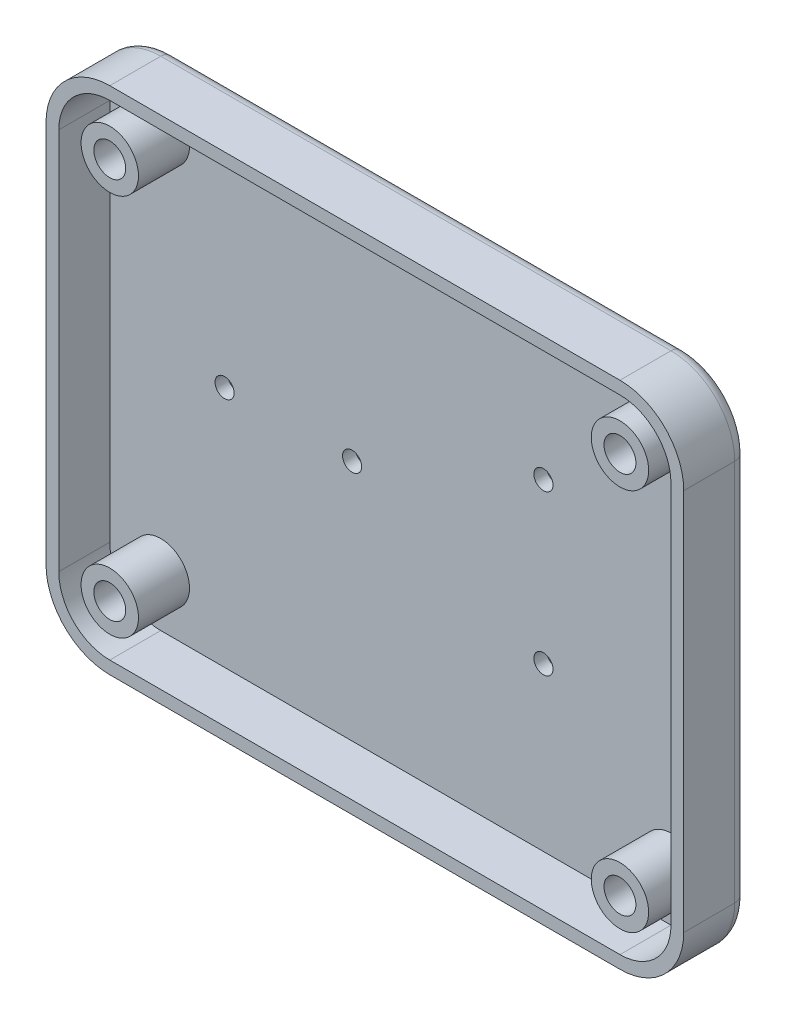
ISO-10303-21;
HEADER;
FILE_DESCRIPTION(('STEP AP214'),'2;1');
FILE_NAME('part.step','',(''),(''),'','','');
FILE_SCHEMA(('AUTOMOTIVE_DESIGN { 1 0 10303 214 1 1 1 1 }'));
ENDSEC;
DATA;
#1=APPLICATION_CONTEXT('core data for automotive mechanical design processes');
#2=APPLICATION_PROTOCOL_DEFINITION('international standard','automotive_design',2000,#1);
#3=PRODUCT_CONTEXT('',#1,'mechanical');
#4=PRODUCT('Part','Part','',(#3));
#5=PRODUCT_RELATED_PRODUCT_CATEGORY('part','',(#4));
#6=PRODUCT_DEFINITION_FORMATION('','',#4);
#7=PRODUCT_DEFINITION_CONTEXT('part definition',#1,'design');
#8=PRODUCT_DEFINITION('design','',#6,#7);
#9=PRODUCT_DEFINITION_SHAPE('','',#8);
#10=(LENGTH_UNIT() NAMED_UNIT(*) SI_UNIT(.MILLI.,.METRE.));
#11=(NAMED_UNIT(*) PLANE_ANGLE_UNIT() SI_UNIT($,.RADIAN.));
#12=(NAMED_UNIT(*) SI_UNIT($,.STERADIAN.) SOLID_ANGLE_UNIT());
#13=UNCERTAINTY_MEASURE_WITH_UNIT(LENGTH_MEASURE(1.E-05),#10,'distance_accuracy_value','');
#14=(GEOMETRIC_REPRESENTATION_CONTEXT(3) GLOBAL_UNCERTAINTY_ASSIGNED_CONTEXT((#13)) GLOBAL_UNIT_ASSIGNED_CONTEXT((#10,
#11,#12)) REPRESENTATION_CONTEXT('',''));
#15=CARTESIAN_POINT('',(0.,0.,0.));
#16=DIRECTION('',(0.,0.,1.));
#17=DIRECTION('',(1.,0.,0.));
#18=AXIS2_PLACEMENT_3D('',#15,#16,#17);
#19=CARTESIAN_POINT('',(0.,0.,10.));
#20=DIRECTION('',(0.,0.,1.));
#21=DIRECTION('',(1.,0.,0.));
#22=AXIS2_PLACEMENT_3D('',#19,#20,#21);
#23=PLANE('',#22);
#24=CARTESIAN_POINT('',(40.,30.,10.));
#25=DIRECTION('',(0.,0.,1.));
#26=DIRECTION('',(1.,0.,0.));
#27=AXIS2_PLACEMENT_3D('',#24,#25,#26);
#28=CIRCLE('',#27,2.5);
#29=CARTESIAN_POINT('',(42.5,30.,10.));
#30=VERTEX_POINT('',#29);
#31=EDGE_CURVE('E330',#30,#30,#28,.T.);
#32=ORIENTED_EDGE('',*,*,#31,.F.);
#33=EDGE_LOOP('',(#32));
#34=FACE_BOUND('',#33,.T.);
#35=CARTESIAN_POINT('',(40.,30.,10.));
#36=DIRECTION('',(0.,0.,1.));
#37=DIRECTION('',(1.,0.,0.));
#38=AXIS2_PLACEMENT_3D('',#35,#36,#37);
#39=CIRCLE('',#38,4.5);
#40=CARTESIAN_POINT('',(44.5,30.,10.));
#41=VERTEX_POINT('',#40);
#42=EDGE_CURVE('E246',#41,#41,#39,.T.);
#43=ORIENTED_EDGE('',*,*,#42,.T.);
#44=EDGE_LOOP('',(#43));
#45=FACE_BOUND('',#44,.T.);
#46=ADVANCED_FACE('F39',(#34,#45),#23,.T.);
#47=CARTESIAN_POINT('',(40.,-30.,10.));
#48=DIRECTION('',(0.,0.,1.));
#49=DIRECTION('',(1.,0.,0.));
#50=AXIS2_PLACEMENT_3D('',#47,#48,#49);
#51=CIRCLE('',#50,2.5);
#52=CARTESIAN_POINT('',(42.5,-30.,10.));
#53=VERTEX_POINT('',#52);
#54=EDGE_CURVE('E322',#53,#53,#51,.T.);
#55=ORIENTED_EDGE('',*,*,#54,.F.);
#56=EDGE_LOOP('',(#55));
#57=FACE_BOUND('',#56,.T.);
#58=CARTESIAN_POINT('',(40.,-30.,10.));
#59=DIRECTION('',(0.,0.,1.));
#60=DIRECTION('',(1.,0.,0.));
#61=AXIS2_PLACEMENT_3D('',#58,#59,#60);
#62=CIRCLE('',#61,4.5);
#63=CARTESIAN_POINT('',(44.5,-30.,10.));
#64=VERTEX_POINT('',#63);
#65=EDGE_CURVE('E245',#64,#64,#62,.T.);
#66=ORIENTED_EDGE('',*,*,#65,.T.);
#67=EDGE_LOOP('',(#66));
#68=FACE_BOUND('',#67,.T.);
#69=ADVANCED_FACE('F577',(#57,#68),#23,.T.);
#70=CARTESIAN_POINT('',(-40.,-30.,10.));
#71=DIRECTION('',(0.,0.,1.));
#72=DIRECTION('',(1.,0.,0.));
#73=AXIS2_PLACEMENT_3D('',#70,#71,#72);
#74=CIRCLE('',#73,2.5);
#75=CARTESIAN_POINT('',(-37.5,-30.,10.));
#76=VERTEX_POINT('',#75);
#77=EDGE_CURVE('E314',#76,#76,#74,.T.);
#78=ORIENTED_EDGE('',*,*,#77,.F.);
#79=EDGE_LOOP('',(#78));
#80=FACE_BOUND('',#79,.T.);
#81=CARTESIAN_POINT('',(-40.,-30.,10.));
#82=DIRECTION('',(0.,0.,1.));
#83=DIRECTION('',(1.,0.,0.));
#84=AXIS2_PLACEMENT_3D('',#81,#82,#83);
#85=CIRCLE('',#84,4.5);
#86=CARTESIAN_POINT('',(-35.5,-30.,10.));
#87=VERTEX_POINT('',#86);
#88=EDGE_CURVE('E251',#87,#87,#85,.T.);
#89=ORIENTED_EDGE('',*,*,#88,.T.);
#90=EDGE_LOOP('',(#89));
#91=FACE_BOUND('',#90,.T.);
#92=ADVANCED_FACE('F556',(#80,#91),#23,.T.);
#93=CARTESIAN_POINT('',(-40.,30.,10.));
#94=DIRECTION('',(0.,0.,1.));
#95=DIRECTION('',(1.,0.,0.));
#96=AXIS2_PLACEMENT_3D('',#93,#94,#95);
#97=CIRCLE('',#96,2.5);
#98=CARTESIAN_POINT('',(-37.5,30.,10.));
#99=VERTEX_POINT('',#98);
#100=EDGE_CURVE('E313',#99,#99,#97,.T.);
#101=ORIENTED_EDGE('',*,*,#100,.F.);
#102=EDGE_LOOP('',(#101));
#103=FACE_BOUND('',#102,.T.);
#104=CARTESIAN_POINT('',(-40.,30.,10.));
#105=DIRECTION('',(0.,0.,1.));
#106=DIRECTION('',(1.,0.,0.));
#107=AXIS2_PLACEMENT_3D('',#104,#105,#106);
#108=CIRCLE('',#107,4.5);
#109=CARTESIAN_POINT('',(-35.5,30.,10.));
#110=VERTEX_POINT('',#109);
#111=EDGE_CURVE('E256',#110,#110,#108,.T.);
#112=ORIENTED_EDGE('',*,*,#111,.T.);
#113=EDGE_LOOP('',(#112));
#114=FACE_BOUND('',#113,.T.);
#115=ADVANCED_FACE('F552',(#103,#114),#23,.T.);
#116=CARTESIAN_POINT('',(50.,40.,10.));
#117=DIRECTION('',(-1.,0.,0.));
#118=DIRECTION('',(0.,-1.,0.));
#119=AXIS2_PLACEMENT_3D('',#116,#117,#118);
#120=PLANE('',#119);
#121=DIRECTION('',(0.,0.,-1.));
#122=VECTOR('',#121,1.);
#123=CARTESIAN_POINT('',(50.,-30.,10.));
#124=LINE('',#123,#122);
#125=CARTESIAN_POINT('',(50.,-30.,10.));
#126=VERTEX_POINT('',#125);
#127=CARTESIAN_POINT('',(50.,-30.,2.));
#128=VERTEX_POINT('',#127);
#129=EDGE_CURVE('E361',#126,#128,#124,.T.);
#130=ORIENTED_EDGE('',*,*,#129,.T.);
#131=DIRECTION('',(0.,1.,0.));
#132=VECTOR('',#131,1.);
#133=CARTESIAN_POINT('',(50.,40.,2.));
#134=LINE('',#133,#132);
#135=CARTESIAN_POINT('',(50.,30.,2.));
#136=VERTEX_POINT('',#135);
#137=EDGE_CURVE('E426',#128,#136,#134,.T.);
#138=ORIENTED_EDGE('',*,*,#137,.T.);
#139=DIRECTION('',(0.,0.,-1.));
#140=VECTOR('',#139,1.);
#141=CARTESIAN_POINT('',(50.,30.,10.));
#142=LINE('',#141,#140);
#143=CARTESIAN_POINT('',(50.,30.,10.));
#144=VERTEX_POINT('',#143);
#145=EDGE_CURVE('E358',#136,#144,#142,.F.);
#146=ORIENTED_EDGE('',*,*,#145,.T.);
#147=DIRECTION('',(0.,1.,0.));
#148=VECTOR('',#147,1.);
#149=CARTESIAN_POINT('',(50.,40.,10.));
#150=LINE('',#149,#148);
#151=EDGE_CURVE('E339',#126,#144,#150,.T.);
#152=ORIENTED_EDGE('',*,*,#151,.F.);
#153=EDGE_LOOP('',(#130,#138,#146,#152));
#154=FACE_BOUND('',#153,.T.);
#155=ADVANCED_FACE('F555',(#154),#120,.F.);
#156=CARTESIAN_POINT('',(-50.,40.,10.));
#157=DIRECTION('',(0.,-1.,0.));
#158=DIRECTION('',(0.,0.,-1.));
#159=AXIS2_PLACEMENT_3D('',#156,#157,#158);
#160=PLANE('',#159);
#161=DIRECTION('',(0.,0.,-1.));
#162=VECTOR('',#161,1.);
#163=CARTESIAN_POINT('',(40.,40.,10.));
#164=LINE('',#163,#162);
#165=CARTESIAN_POINT('',(40.,40.,10.));
#166=VERTEX_POINT('',#165);
#167=CARTESIAN_POINT('',(40.,40.,2.));
#168=VERTEX_POINT('',#167);
#169=EDGE_CURVE('E391',#166,#168,#164,.T.);
#170=ORIENTED_EDGE('',*,*,#169,.T.);
#171=DIRECTION('',(-1.,0.,0.));
#172=VECTOR('',#171,1.);
#173=CARTESIAN_POINT('',(-50.,40.,2.));
#174=LINE('',#173,#172);
#175=CARTESIAN_POINT('',(-40.,40.,2.));
#176=VERTEX_POINT('',#175);
#177=EDGE_CURVE('E11',#168,#176,#174,.T.);
#178=ORIENTED_EDGE('',*,*,#177,.T.);
#179=DIRECTION('',(0.,0.,-1.));
#180=VECTOR('',#179,1.);
#181=CARTESIAN_POINT('',(-40.,40.,10.));
#182=LINE('',#181,#180);
#183=CARTESIAN_POINT('',(-40.,40.,10.));
#184=VERTEX_POINT('',#183);
#185=EDGE_CURVE('E394',#176,#184,#182,.F.);
#186=ORIENTED_EDGE('',*,*,#185,.T.);
#187=DIRECTION('',(-1.,0.,0.));
#188=VECTOR('',#187,1.);
#189=CARTESIAN_POINT('',(-50.,40.,10.));
#190=LINE('',#189,#188);
#191=EDGE_CURVE('E346',#166,#184,#190,.T.);
#192=ORIENTED_EDGE('',*,*,#191,.F.);
#193=EDGE_LOOP('',(#170,#178,#186,#192));
#194=FACE_BOUND('',#193,.T.);
#195=ADVANCED_FACE('F626',(#194),#160,.F.);
#196=CARTESIAN_POINT('',(-50.,40.,10.));
#197=DIRECTION('',(1.,0.,0.));
#198=DIRECTION('',(0.,1.,0.));
#199=AXIS2_PLACEMENT_3D('',#196,#197,#198);
#200=PLANE('',#199);
#201=DIRECTION('',(0.,0.,-1.));
#202=VECTOR('',#201,1.);
#203=CARTESIAN_POINT('',(-50.,30.,10.));
#204=LINE('',#203,#202);
#205=CARTESIAN_POINT('',(-50.,30.,10.));
#206=VERTEX_POINT('',#205);
#207=CARTESIAN_POINT('',(-50.,30.,2.));
#208=VERTEX_POINT('',#207);
#209=EDGE_CURVE('E384',#206,#208,#204,.T.);
#210=ORIENTED_EDGE('',*,*,#209,.T.);
#211=DIRECTION('',(0.,-1.,0.));
#212=VECTOR('',#211,1.);
#213=CARTESIAN_POINT('',(-50.,40.,2.));
#214=LINE('',#213,#212);
#215=CARTESIAN_POINT('',(-50.,-30.,2.));
#216=VERTEX_POINT('',#215);
#217=EDGE_CURVE('E438',#208,#216,#214,.T.);
#218=ORIENTED_EDGE('',*,*,#217,.T.);
#219=DIRECTION('',(0.,0.,-1.));
#220=VECTOR('',#219,1.);
#221=CARTESIAN_POINT('',(-50.,-30.,10.));
#222=LINE('',#221,#220);
#223=CARTESIAN_POINT('',(-50.,-30.,10.));
#224=VERTEX_POINT('',#223);
#225=EDGE_CURVE('E388',#216,#224,#222,.F.);
#226=ORIENTED_EDGE('',*,*,#225,.T.);
#227=DIRECTION('',(0.,-1.,0.));
#228=VECTOR('',#227,1.);
#229=CARTESIAN_POINT('',(-50.,40.,10.));
#230=LINE('',#229,#228);
#231=EDGE_CURVE('E350',#206,#224,#230,.T.);
#232=ORIENTED_EDGE('',*,*,#231,.F.);
#233=EDGE_LOOP('',(#210,#218,#226,#232));
#234=FACE_BOUND('',#233,.T.);
#235=ADVANCED_FACE('F591',(#234),#200,.F.);
#236=CARTESIAN_POINT('',(-50.,-40.,10.));
#237=DIRECTION('',(0.,1.,0.));
#238=DIRECTION('',(0.,0.,1.));
#239=AXIS2_PLACEMENT_3D('',#236,#237,#238);
#240=PLANE('',#239);
#241=DIRECTION('',(0.,0.,-1.));
#242=VECTOR('',#241,1.);
#243=CARTESIAN_POINT('',(-40.,-40.,10.));
#244=LINE('',#243,#242);
#245=CARTESIAN_POINT('',(-40.,-40.,10.));
#246=VERTEX_POINT('',#245);
#247=CARTESIAN_POINT('',(-40.,-40.,2.));
#248=VERTEX_POINT('',#247);
#249=EDGE_CURVE('E365',#246,#248,#244,.T.);
#250=ORIENTED_EDGE('',*,*,#249,.T.);
#251=DIRECTION('',(1.,0.,0.));
#252=VECTOR('',#251,1.);
#253=CARTESIAN_POINT('',(-50.,-40.,2.));
#254=LINE('',#253,#252);
#255=CARTESIAN_POINT('',(40.,-40.,2.));
#256=VERTEX_POINT('',#255);
#257=EDGE_CURVE('E432',#248,#256,#254,.T.);
#258=ORIENTED_EDGE('',*,*,#257,.T.);
#259=DIRECTION('',(0.,0.,-1.));
#260=VECTOR('',#259,1.);
#261=CARTESIAN_POINT('',(40.,-40.,10.));
#262=LINE('',#261,#260);
#263=CARTESIAN_POINT('',(40.,-40.,10.));
#264=VERTEX_POINT('',#263);
#265=EDGE_CURVE('E369',#256,#264,#262,.F.);
#266=ORIENTED_EDGE('',*,*,#265,.T.);
#267=DIRECTION('',(1.,0.,0.));
#268=VECTOR('',#267,1.);
#269=CARTESIAN_POINT('',(-50.,-40.,10.));
#270=LINE('',#269,#268);
#271=EDGE_CURVE('E354',#246,#264,#270,.T.);
#272=ORIENTED_EDGE('',*,*,#271,.F.);
#273=EDGE_LOOP('',(#250,#258,#266,#272));
#274=FACE_BOUND('',#273,.T.);
#275=ADVANCED_FACE('F586',(#274),#240,.F.);
#276=DIRECTION('',(1.,0.,0.));
#277=VECTOR('',#276,1.);
#278=CARTESIAN_POINT('',(-50.,-38.,10.));
#279=LINE('',#278,#277);
#280=CARTESIAN_POINT('',(-40.,-38.,10.));
#281=VERTEX_POINT('',#280);
#282=CARTESIAN_POINT('',(40.,-38.,10.));
#283=VERTEX_POINT('',#282);
#284=EDGE_CURVE('E215',#281,#283,#279,.T.);
#285=ORIENTED_EDGE('',*,*,#284,.F.);
#286=CARTESIAN_POINT('',(-40.,-30.,10.));
#287=DIRECTION('',(0.,0.,1.));
#288=DIRECTION('',(1.,0.,0.));
#289=AXIS2_PLACEMENT_3D('',#286,#287,#288);
#290=CIRCLE('',#289,8.);
#291=CARTESIAN_POINT('',(-48.,-30.,10.));
#292=VERTEX_POINT('',#291);
#293=EDGE_CURVE('E287',#292,#281,#290,.T.);
#294=ORIENTED_EDGE('',*,*,#293,.F.);
#295=DIRECTION('',(0.,-1.,0.));
#296=VECTOR('',#295,1.);
#297=CARTESIAN_POINT('',(-48.,40.,10.));
#298=LINE('',#297,#296);
#299=CARTESIAN_POINT('',(-48.,30.,10.));
#300=VERTEX_POINT('',#299);
#301=EDGE_CURVE('E57',#300,#292,#298,.T.);
#302=ORIENTED_EDGE('',*,*,#301,.F.);
#303=CARTESIAN_POINT('',(-40.,30.,10.));
#304=DIRECTION('',(0.,0.,1.));
#305=DIRECTION('',(1.,0.,0.));
#306=AXIS2_PLACEMENT_3D('',#303,#304,#305);
#307=CIRCLE('',#306,8.);
#308=CARTESIAN_POINT('',(-40.,38.,10.));
#309=VERTEX_POINT('',#308);
#310=EDGE_CURVE('E281',#309,#300,#307,.T.);
#311=ORIENTED_EDGE('',*,*,#310,.F.);
#312=DIRECTION('',(-1.,0.,0.));
#313=VECTOR('',#312,1.);
#314=CARTESIAN_POINT('',(-50.,38.,10.));
#315=LINE('',#314,#313);
#316=CARTESIAN_POINT('',(40.,38.,10.));
#317=VERTEX_POINT('',#316);
#318=EDGE_CURVE('E278',#317,#309,#315,.T.);
#319=ORIENTED_EDGE('',*,*,#318,.F.);
#320=CARTESIAN_POINT('',(40.,30.,10.));
#321=DIRECTION('',(0.,0.,1.));
#322=DIRECTION('',(1.,0.,0.));
#323=AXIS2_PLACEMENT_3D('',#320,#321,#322);
#324=CIRCLE('',#323,8.);
#325=CARTESIAN_POINT('',(48.,30.,10.));
#326=VERTEX_POINT('',#325);
#327=EDGE_CURVE('E275',#326,#317,#324,.T.);
#328=ORIENTED_EDGE('',*,*,#327,.F.);
#329=DIRECTION('',(0.,1.,0.));
#330=VECTOR('',#329,1.);
#331=CARTESIAN_POINT('',(48.,40.,10.));
#332=LINE('',#331,#330);
#333=CARTESIAN_POINT('',(48.,-30.,10.));
#334=VERTEX_POINT('',#333);
#335=EDGE_CURVE('E261',#334,#326,#332,.T.);
#336=ORIENTED_EDGE('',*,*,#335,.F.);
#337=CARTESIAN_POINT('',(40.,-30.,10.));
#338=DIRECTION('',(0.,0.,1.));
#339=DIRECTION('',(1.,0.,0.));
#340=AXIS2_PLACEMENT_3D('',#337,#338,#339);
#341=CIRCLE('',#340,8.);
#342=EDGE_CURVE('E206',#283,#334,#341,.T.);
#343=ORIENTED_EDGE('',*,*,#342,.F.);
#344=EDGE_LOOP('',(#285,#294,#302,#311,#319,#328,#336,#343));
#345=FACE_BOUND('',#344,.T.);
#346=ORIENTED_EDGE('',*,*,#271,.T.);
#347=CARTESIAN_POINT('',(40.,-30.,10.));
#348=DIRECTION('',(0.,0.,1.));
#349=DIRECTION('',(1.,0.,0.));
#350=AXIS2_PLACEMENT_3D('',#347,#348,#349);
#351=CIRCLE('',#350,10.);
#352=EDGE_CURVE('E381',#264,#126,#351,.T.);
#353=ORIENTED_EDGE('',*,*,#352,.T.);
#354=ORIENTED_EDGE('',*,*,#151,.T.);
#355=CARTESIAN_POINT('',(40.,30.,10.));
#356=DIRECTION('',(0.,0.,1.));
#357=DIRECTION('',(1.,0.,0.));
#358=AXIS2_PLACEMENT_3D('',#355,#356,#357);
#359=CIRCLE('',#358,10.);
#360=EDGE_CURVE('E372',#144,#166,#359,.T.);
#361=ORIENTED_EDGE('',*,*,#360,.T.);
#362=ORIENTED_EDGE('',*,*,#191,.T.);
#363=CARTESIAN_POINT('',(-40.,30.,10.));
#364=DIRECTION('',(0.,0.,1.));
#365=DIRECTION('',(1.,0.,0.));
#366=AXIS2_PLACEMENT_3D('',#363,#364,#365);
#367=CIRCLE('',#366,10.);
#368=EDGE_CURVE('E375',#184,#206,#367,.T.);
#369=ORIENTED_EDGE('',*,*,#368,.T.);
#370=ORIENTED_EDGE('',*,*,#231,.T.);
#371=CARTESIAN_POINT('',(-40.,-30.,10.));
#372=DIRECTION('',(0.,0.,1.));
#373=DIRECTION('',(1.,0.,0.));
#374=AXIS2_PLACEMENT_3D('',#371,#372,#373);
#375=CIRCLE('',#374,10.);
#376=EDGE_CURVE('E378',#224,#246,#375,.T.);
#377=ORIENTED_EDGE('',*,*,#376,.T.);
#378=EDGE_LOOP('',(#346,#353,#354,#361,#362,#369,#370,#377));
#379=FACE_BOUND('',#378,.T.);
#380=ADVANCED_FACE('F528',(#345,#379),#23,.T.);
#381=CARTESIAN_POINT('',(0.,0.,0.));
#382=DIRECTION('',(0.,0.,1.));
#383=DIRECTION('',(1.,0.,0.));
#384=AXIS2_PLACEMENT_3D('',#381,#382,#383);
#385=PLANE('',#384);
#386=CARTESIAN_POINT('',(-30.,0.,0.));
#387=DIRECTION('',(0.,0.,-1.));
#388=DIRECTION('',(-1.,0.,0.));
#389=AXIS2_PLACEMENT_3D('',#386,#387,#388);
#390=CIRCLE('',#389,1.5);
#391=CARTESIAN_POINT('',(-31.5,0.,0.));
#392=VERTEX_POINT('',#391);
#393=EDGE_CURVE('E476',#392,#392,#390,.T.);
#394=ORIENTED_EDGE('',*,*,#393,.F.);
#395=EDGE_LOOP('',(#394));
#396=FACE_BOUND('',#395,.T.);
#397=CARTESIAN_POINT('',(-10.,0.,0.));
#398=DIRECTION('',(0.,0.,-1.));
#399=DIRECTION('',(-1.,0.,0.));
#400=AXIS2_PLACEMENT_3D('',#397,#398,#399);
#401=CIRCLE('',#400,1.5);
#402=CARTESIAN_POINT('',(-11.5,0.,0.));
#403=VERTEX_POINT('',#402);
#404=EDGE_CURVE('E513',#403,#403,#401,.T.);
#405=ORIENTED_EDGE('',*,*,#404,.F.);
#406=EDGE_LOOP('',(#405));
#407=FACE_BOUND('',#406,.T.);
#408=CARTESIAN_POINT('',(20.,-12.5,0.));
#409=DIRECTION('',(0.,0.,-1.));
#410=DIRECTION('',(-1.,0.,0.));
#411=AXIS2_PLACEMENT_3D('',#408,#409,#410);
#412=CIRCLE('',#411,1.5);
#413=CARTESIAN_POINT('',(18.5,-12.5,0.));
#414=VERTEX_POINT('',#413);
#415=EDGE_CURVE('E510',#414,#414,#412,.T.);
#416=ORIENTED_EDGE('',*,*,#415,.F.);
#417=EDGE_LOOP('',(#416));
#418=FACE_BOUND('',#417,.T.);
#419=CARTESIAN_POINT('',(20.,12.5,0.));
#420=DIRECTION('',(0.,0.,-1.));
#421=DIRECTION('',(-1.,0.,0.));
#422=AXIS2_PLACEMENT_3D('',#419,#420,#421);
#423=CIRCLE('',#422,1.5);
#424=CARTESIAN_POINT('',(18.5,12.5,0.));
#425=VERTEX_POINT('',#424);
#426=EDGE_CURVE('E218',#425,#425,#423,.T.);
#427=ORIENTED_EDGE('',*,*,#426,.F.);
#428=EDGE_LOOP('',(#427));
#429=FACE_BOUND('',#428,.T.);
#430=DIRECTION('',(-1.,0.,0.));
#431=VECTOR('',#430,1.);
#432=CARTESIAN_POINT('',(0.,38.,0.));
#433=LINE('',#432,#431);
#434=CARTESIAN_POINT('',(-40.,38.,0.));
#435=VERTEX_POINT('',#434);
#436=CARTESIAN_POINT('',(40.,38.,0.));
#437=VERTEX_POINT('',#436);
#438=EDGE_CURVE('E397',#435,#437,#433,.F.);
#439=ORIENTED_EDGE('',*,*,#438,.T.);
#440=CARTESIAN_POINT('',(40.,30.,0.));
#441=DIRECTION('',(0.,0.,1.));
#442=DIRECTION('',(1.,0.,0.));
#443=AXIS2_PLACEMENT_3D('',#440,#441,#442);
#444=CIRCLE('',#443,8.);
#445=CARTESIAN_POINT('',(48.,30.,0.));
#446=VERTEX_POINT('',#445);
#447=EDGE_CURVE('E418',#437,#446,#444,.F.);
#448=ORIENTED_EDGE('',*,*,#447,.T.);
#449=DIRECTION('',(0.,1.,0.));
#450=VECTOR('',#449,1.);
#451=CARTESIAN_POINT('',(48.,0.,0.));
#452=LINE('',#451,#450);
#453=CARTESIAN_POINT('',(48.,-30.,0.));
#454=VERTEX_POINT('',#453);
#455=EDGE_CURVE('E415',#446,#454,#452,.F.);
#456=ORIENTED_EDGE('',*,*,#455,.T.);
#457=CARTESIAN_POINT('',(40.,-30.,0.));
#458=DIRECTION('',(0.,0.,1.));
#459=DIRECTION('',(1.,0.,0.));
#460=AXIS2_PLACEMENT_3D('',#457,#458,#459);
#461=CIRCLE('',#460,8.);
#462=CARTESIAN_POINT('',(40.,-38.,0.));
#463=VERTEX_POINT('',#462);
#464=EDGE_CURVE('E412',#454,#463,#461,.F.);
#465=ORIENTED_EDGE('',*,*,#464,.T.);
#466=DIRECTION('',(1.,0.,0.));
#467=VECTOR('',#466,1.);
#468=CARTESIAN_POINT('',(0.,-38.,0.));
#469=LINE('',#468,#467);
#470=CARTESIAN_POINT('',(-40.,-38.,0.));
#471=VERTEX_POINT('',#470);
#472=EDGE_CURVE('E409',#463,#471,#469,.F.);
#473=ORIENTED_EDGE('',*,*,#472,.T.);
#474=CARTESIAN_POINT('',(-40.,-30.,0.));
#475=DIRECTION('',(0.,0.,1.));
#476=DIRECTION('',(1.,0.,0.));
#477=AXIS2_PLACEMENT_3D('',#474,#475,#476);
#478=CIRCLE('',#477,8.);
#479=CARTESIAN_POINT('',(-48.,-30.,0.));
#480=VERTEX_POINT('',#479);
#481=EDGE_CURVE('E406',#471,#480,#478,.F.);
#482=ORIENTED_EDGE('',*,*,#481,.T.);
#483=DIRECTION('',(0.,-1.,0.));
#484=VECTOR('',#483,1.);
#485=CARTESIAN_POINT('',(-48.,0.,0.));
#486=LINE('',#485,#484);
#487=CARTESIAN_POINT('',(-48.,30.,0.));
#488=VERTEX_POINT('',#487);
#489=EDGE_CURVE('E403',#480,#488,#486,.F.);
#490=ORIENTED_EDGE('',*,*,#489,.T.);
#491=CARTESIAN_POINT('',(-40.,30.,0.));
#492=DIRECTION('',(0.,0.,1.));
#493=DIRECTION('',(1.,0.,0.));
#494=AXIS2_PLACEMENT_3D('',#491,#492,#493);
#495=CIRCLE('',#494,8.);
#496=EDGE_CURVE('E400',#488,#435,#495,.F.);
#497=ORIENTED_EDGE('',*,*,#496,.T.);
#498=EDGE_LOOP('',(#439,#448,#456,#465,#473,#482,#490,#497));
#499=FACE_BOUND('',#498,.T.);
#500=CARTESIAN_POINT('',(40.,30.,0.));
#501=DIRECTION('',(0.,0.,1.));
#502=DIRECTION('',(1.,0.,0.));
#503=AXIS2_PLACEMENT_3D('',#500,#501,#502);
#504=CIRCLE('',#503,2.5);
#505=CARTESIAN_POINT('',(42.5,30.,0.));
#506=VERTEX_POINT('',#505);
#507=EDGE_CURVE('E326',#506,#506,#504,.T.);
#508=ORIENTED_EDGE('',*,*,#507,.T.);
#509=EDGE_LOOP('',(#508));
#510=FACE_BOUND('',#509,.T.);
#511=CARTESIAN_POINT('',(40.,-30.,0.));
#512=DIRECTION('',(0.,0.,1.));
#513=DIRECTION('',(1.,0.,0.));
#514=AXIS2_PLACEMENT_3D('',#511,#512,#513);
#515=CIRCLE('',#514,2.5);
#516=CARTESIAN_POINT('',(42.5,-30.,0.));
#517=VERTEX_POINT('',#516);
#518=EDGE_CURVE('E318',#517,#517,#515,.T.);
#519=ORIENTED_EDGE('',*,*,#518,.T.);
#520=EDGE_LOOP('',(#519));
#521=FACE_BOUND('',#520,.T.);
#522=CARTESIAN_POINT('',(-40.,-30.,0.));
#523=DIRECTION('',(0.,0.,1.));
#524=DIRECTION('',(1.,0.,0.));
#525=AXIS2_PLACEMENT_3D('',#522,#523,#524);
#526=CIRCLE('',#525,2.5);
#527=CARTESIAN_POINT('',(-37.5,-30.,0.));
#528=VERTEX_POINT('',#527);
#529=EDGE_CURVE('E309',#528,#528,#526,.T.);
#530=ORIENTED_EDGE('',*,*,#529,.T.);
#531=EDGE_LOOP('',(#530));
#532=FACE_BOUND('',#531,.T.);
#533=CARTESIAN_POINT('',(-40.,30.,0.));
#534=DIRECTION('',(0.,0.,1.));
#535=DIRECTION('',(1.,0.,0.));
#536=AXIS2_PLACEMENT_3D('',#533,#534,#535);
#537=CIRCLE('',#536,2.5);
#538=CARTESIAN_POINT('',(-37.5,30.,0.));
#539=VERTEX_POINT('',#538);
#540=EDGE_CURVE('E335',#539,#539,#537,.T.);
#541=ORIENTED_EDGE('',*,*,#540,.T.);
#542=EDGE_LOOP('',(#541));
#543=FACE_BOUND('',#542,.T.);
#544=ADVANCED_FACE('F524',(#396,#407,#418,#429,#499,#510,#521,#532,#543),#385,.F.);
#545=CARTESIAN_POINT('',(40.,-30.,10.));
#546=DIRECTION('',(0.,0.,-1.));
#547=DIRECTION('',(-1.,0.,0.));
#548=AXIS2_PLACEMENT_3D('',#545,#546,#547);
#549=CYLINDRICAL_SURFACE('',#548,10.);
#550=ORIENTED_EDGE('',*,*,#265,.F.);
#551=CARTESIAN_POINT('',(40.,-30.,2.));
#552=DIRECTION('',(0.,0.,1.));
#553=DIRECTION('',(1.,0.,0.));
#554=AXIS2_PLACEMENT_3D('',#551,#552,#553);
#555=CIRCLE('',#554,10.);
#556=EDGE_CURVE('E429',#256,#128,#555,.T.);
#557=ORIENTED_EDGE('',*,*,#556,.T.);
#558=ORIENTED_EDGE('',*,*,#129,.F.);
#559=ORIENTED_EDGE('',*,*,#352,.F.);
#560=EDGE_LOOP('',(#550,#557,#558,#559));
#561=FACE_BOUND('',#560,.T.);
#562=ADVANCED_FACE('F527',(#561),#549,.T.);
#563=CARTESIAN_POINT('',(-40.,-30.,10.));
#564=DIRECTION('',(0.,0.,-1.));
#565=DIRECTION('',(-1.,0.,0.));
#566=AXIS2_PLACEMENT_3D('',#563,#564,#565);
#567=CYLINDRICAL_SURFACE('',#566,10.);
#568=ORIENTED_EDGE('',*,*,#225,.F.);
#569=CARTESIAN_POINT('',(-40.,-30.,2.));
#570=DIRECTION('',(0.,0.,1.));
#571=DIRECTION('',(1.,0.,0.));
#572=AXIS2_PLACEMENT_3D('',#569,#570,#571);
#573=CIRCLE('',#572,10.);
#574=EDGE_CURVE('E435',#216,#248,#573,.T.);
#575=ORIENTED_EDGE('',*,*,#574,.T.);
#576=ORIENTED_EDGE('',*,*,#249,.F.);
#577=ORIENTED_EDGE('',*,*,#376,.F.);
#578=EDGE_LOOP('',(#568,#575,#576,#577));
#579=FACE_BOUND('',#578,.T.);
#580=ADVANCED_FACE('F652',(#579),#567,.T.);
#581=CARTESIAN_POINT('',(-40.,30.,10.));
#582=DIRECTION('',(0.,0.,-1.));
#583=DIRECTION('',(-1.,0.,0.));
#584=AXIS2_PLACEMENT_3D('',#581,#582,#583);
#585=CYLINDRICAL_SURFACE('',#584,10.);
#586=ORIENTED_EDGE('',*,*,#185,.F.);
#587=CARTESIAN_POINT('',(-40.,30.,2.));
#588=DIRECTION('',(0.,0.,1.));
#589=DIRECTION('',(1.,0.,0.));
#590=AXIS2_PLACEMENT_3D('',#587,#588,#589);
#591=CIRCLE('',#590,10.);
#592=EDGE_CURVE('E49',#176,#208,#591,.T.);
#593=ORIENTED_EDGE('',*,*,#592,.T.);
#594=ORIENTED_EDGE('',*,*,#209,.F.);
#595=ORIENTED_EDGE('',*,*,#368,.F.);
#596=EDGE_LOOP('',(#586,#593,#594,#595));
#597=FACE_BOUND('',#596,.T.);
#598=ADVANCED_FACE('F631',(#597),#585,.T.);
#599=CARTESIAN_POINT('',(40.,30.,10.));
#600=DIRECTION('',(0.,0.,-1.));
#601=DIRECTION('',(-1.,0.,0.));
#602=AXIS2_PLACEMENT_3D('',#599,#600,#601);
#603=CYLINDRICAL_SURFACE('',#602,10.);
#604=ORIENTED_EDGE('',*,*,#145,.F.);
#605=CARTESIAN_POINT('',(40.,30.,2.));
#606=DIRECTION('',(0.,0.,1.));
#607=DIRECTION('',(1.,0.,0.));
#608=AXIS2_PLACEMENT_3D('',#605,#606,#607);
#609=CIRCLE('',#608,10.);
#610=EDGE_CURVE('E422',#136,#168,#609,.T.);
#611=ORIENTED_EDGE('',*,*,#610,.T.);
#612=ORIENTED_EDGE('',*,*,#169,.F.);
#613=ORIENTED_EDGE('',*,*,#360,.F.);
#614=EDGE_LOOP('',(#604,#611,#612,#613));
#615=FACE_BOUND('',#614,.T.);
#616=ADVANCED_FACE('F548',(#615),#603,.T.);
#617=CARTESIAN_POINT('',(-40.,30.,0.));
#618=DIRECTION('',(0.,0.,1.));
#619=DIRECTION('',(1.,0.,0.));
#620=AXIS2_PLACEMENT_3D('',#617,#618,#619);
#621=CYLINDRICAL_SURFACE('',#620,2.5);
#622=ORIENTED_EDGE('',*,*,#540,.F.);
#623=EDGE_LOOP('',(#622));
#624=FACE_BOUND('',#623,.T.);
#625=ORIENTED_EDGE('',*,*,#100,.T.);
#626=EDGE_LOOP('',(#625));
#627=FACE_BOUND('',#626,.T.);
#628=ADVANCED_FACE('F544',(#624,#627),#621,.F.);
#629=CARTESIAN_POINT('',(-40.,-30.,0.));
#630=DIRECTION('',(0.,0.,1.));
#631=DIRECTION('',(1.,0.,0.));
#632=AXIS2_PLACEMENT_3D('',#629,#630,#631);
#633=CYLINDRICAL_SURFACE('',#632,2.5);
#634=ORIENTED_EDGE('',*,*,#529,.F.);
#635=EDGE_LOOP('',(#634));
#636=FACE_BOUND('',#635,.T.);
#637=ORIENTED_EDGE('',*,*,#77,.T.);
#638=EDGE_LOOP('',(#637));
#639=FACE_BOUND('',#638,.T.);
#640=ADVANCED_FACE('F547',(#636,#639),#633,.F.);
#641=CARTESIAN_POINT('',(40.,-30.,0.));
#642=DIRECTION('',(0.,0.,1.));
#643=DIRECTION('',(1.,0.,0.));
#644=AXIS2_PLACEMENT_3D('',#641,#642,#643);
#645=CYLINDRICAL_SURFACE('',#644,2.5);
#646=ORIENTED_EDGE('',*,*,#518,.F.);
#647=EDGE_LOOP('',(#646));
#648=FACE_BOUND('',#647,.T.);
#649=ORIENTED_EDGE('',*,*,#54,.T.);
#650=EDGE_LOOP('',(#649));
#651=FACE_BOUND('',#650,.T.);
#652=ADVANCED_FACE('F947',(#648,#651),#645,.F.);
#653=CARTESIAN_POINT('',(40.,30.,0.));
#654=DIRECTION('',(0.,0.,1.));
#655=DIRECTION('',(1.,0.,0.));
#656=AXIS2_PLACEMENT_3D('',#653,#654,#655);
#657=CYLINDRICAL_SURFACE('',#656,2.5);
#658=ORIENTED_EDGE('',*,*,#507,.F.);
#659=EDGE_LOOP('',(#658));
#660=FACE_BOUND('',#659,.T.);
#661=ORIENTED_EDGE('',*,*,#31,.T.);
#662=EDGE_LOOP('',(#661));
#663=FACE_BOUND('',#662,.T.);
#664=ADVANCED_FACE('F730',(#660,#663),#657,.F.);
#665=CARTESIAN_POINT('',(-40.,-30.,2.));
#666=DIRECTION('',(0.,0.,1.));
#667=DIRECTION('',(1.,0.,0.));
#668=AXIS2_PLACEMENT_3D('',#665,#666,#667);
#669=TOROIDAL_SURFACE('',#668,8.,2.);
#670=CARTESIAN_POINT('',(-40.,-38.,2.));
#671=DIRECTION('',(1.,0.,0.));
#672=DIRECTION('',(0.,0.,-1.));
#673=AXIS2_PLACEMENT_3D('',#670,#671,#672);
#674=CIRCLE('',#673,2.);
#675=EDGE_CURVE('E464',#248,#471,#674,.T.);
#676=ORIENTED_EDGE('',*,*,#675,.F.);
#677=ORIENTED_EDGE('',*,*,#574,.F.);
#678=CARTESIAN_POINT('',(-48.,-30.,2.));
#679=DIRECTION('',(0.,1.,0.));
#680=DIRECTION('',(0.,0.,1.));
#681=AXIS2_PLACEMENT_3D('',#678,#679,#680);
#682=CIRCLE('',#681,2.);
#683=EDGE_CURVE('E334',#480,#216,#682,.T.);
#684=ORIENTED_EDGE('',*,*,#683,.F.);
#685=ORIENTED_EDGE('',*,*,#481,.F.);
#686=EDGE_LOOP('',(#676,#677,#684,#685));
#687=FACE_BOUND('',#686,.T.);
#688=ADVANCED_FACE('F41',(#687),#669,.T.);
#689=CARTESIAN_POINT('',(-48.,40.,2.));
#690=DIRECTION('',(0.,-1.,0.));
#691=DIRECTION('',(1.,0.,0.));
#692=AXIS2_PLACEMENT_3D('',#689,#690,#691);
#693=CYLINDRICAL_SURFACE('',#692,2.);
#694=ORIENTED_EDGE('',*,*,#683,.T.);
#695=ORIENTED_EDGE('',*,*,#217,.F.);
#696=CARTESIAN_POINT('',(-48.,30.,2.));
#697=DIRECTION('',(0.,1.,0.));
#698=DIRECTION('',(0.,0.,1.));
#699=AXIS2_PLACEMENT_3D('',#696,#697,#698);
#700=CIRCLE('',#699,2.);
#701=EDGE_CURVE('E460',#488,#208,#700,.T.);
#702=ORIENTED_EDGE('',*,*,#701,.F.);
#703=ORIENTED_EDGE('',*,*,#489,.F.);
#704=EDGE_LOOP('',(#694,#695,#702,#703));
#705=FACE_BOUND('',#704,.T.);
#706=ADVANCED_FACE('F638',(#705),#693,.T.);
#707=CARTESIAN_POINT('',(-50.,-38.,2.));
#708=DIRECTION('',(1.,0.,0.));
#709=DIRECTION('',(0.,0.,-1.));
#710=AXIS2_PLACEMENT_3D('',#707,#708,#709);
#711=CYLINDRICAL_SURFACE('',#710,2.);
#712=ORIENTED_EDGE('',*,*,#675,.T.);
#713=ORIENTED_EDGE('',*,*,#472,.F.);
#714=CARTESIAN_POINT('',(40.,-38.,2.));
#715=DIRECTION('',(1.,0.,0.));
#716=DIRECTION('',(0.,0.,-1.));
#717=AXIS2_PLACEMENT_3D('',#714,#715,#716);
#718=CIRCLE('',#717,2.);
#719=EDGE_CURVE('E456',#256,#463,#718,.T.);
#720=ORIENTED_EDGE('',*,*,#719,.F.);
#721=ORIENTED_EDGE('',*,*,#257,.F.);
#722=EDGE_LOOP('',(#712,#713,#720,#721));
#723=FACE_BOUND('',#722,.T.);
#724=ADVANCED_FACE('F654',(#723),#711,.T.);
#725=CARTESIAN_POINT('',(-40.,30.,2.));
#726=DIRECTION('',(0.,0.,1.));
#727=DIRECTION('',(1.,0.,0.));
#728=AXIS2_PLACEMENT_3D('',#725,#726,#727);
#729=TOROIDAL_SURFACE('',#728,8.,2.);
#730=ORIENTED_EDGE('',*,*,#701,.T.);
#731=ORIENTED_EDGE('',*,*,#592,.F.);
#732=CARTESIAN_POINT('',(-40.,38.,2.));
#733=DIRECTION('',(1.,0.,0.));
#734=DIRECTION('',(0.,0.,-1.));
#735=AXIS2_PLACEMENT_3D('',#732,#733,#734);
#736=CIRCLE('',#735,2.);
#737=EDGE_CURVE('E452',#435,#176,#736,.T.);
#738=ORIENTED_EDGE('',*,*,#737,.F.);
#739=ORIENTED_EDGE('',*,*,#496,.F.);
#740=EDGE_LOOP('',(#730,#731,#738,#739));
#741=FACE_BOUND('',#740,.T.);
#742=ADVANCED_FACE('F643',(#741),#729,.T.);
#743=CARTESIAN_POINT('',(40.,-30.,2.));
#744=DIRECTION('',(0.,0.,1.));
#745=DIRECTION('',(1.,0.,0.));
#746=AXIS2_PLACEMENT_3D('',#743,#744,#745);
#747=TOROIDAL_SURFACE('',#746,8.,2.);
#748=ORIENTED_EDGE('',*,*,#719,.T.);
#749=ORIENTED_EDGE('',*,*,#464,.F.);
#750=CARTESIAN_POINT('',(48.,-30.,2.));
#751=DIRECTION('',(0.,1.,0.));
#752=DIRECTION('',(0.,0.,1.));
#753=AXIS2_PLACEMENT_3D('',#750,#751,#752);
#754=CIRCLE('',#753,2.);
#755=EDGE_CURVE('E448',#128,#454,#754,.T.);
#756=ORIENTED_EDGE('',*,*,#755,.F.);
#757=ORIENTED_EDGE('',*,*,#556,.F.);
#758=EDGE_LOOP('',(#748,#749,#756,#757));
#759=FACE_BOUND('',#758,.T.);
#760=ADVANCED_FACE('F613',(#759),#747,.T.);
#761=CARTESIAN_POINT('',(-50.,38.,2.));
#762=DIRECTION('',(-1.,0.,0.));
#763=DIRECTION('',(0.,0.,1.));
#764=AXIS2_PLACEMENT_3D('',#761,#762,#763);
#765=CYLINDRICAL_SURFACE('',#764,2.);
#766=ORIENTED_EDGE('',*,*,#737,.T.);
#767=ORIENTED_EDGE('',*,*,#177,.F.);
#768=CARTESIAN_POINT('',(40.,38.,2.));
#769=DIRECTION('',(1.,0.,0.));
#770=DIRECTION('',(0.,0.,-1.));
#771=AXIS2_PLACEMENT_3D('',#768,#769,#770);
#772=CIRCLE('',#771,2.);
#773=EDGE_CURVE('E445',#437,#168,#772,.T.);
#774=ORIENTED_EDGE('',*,*,#773,.F.);
#775=ORIENTED_EDGE('',*,*,#438,.F.);
#776=EDGE_LOOP('',(#766,#767,#774,#775));
#777=FACE_BOUND('',#776,.T.);
#778=ADVANCED_FACE('F665',(#777),#765,.T.);
#779=CARTESIAN_POINT('',(48.,40.,2.));
#780=DIRECTION('',(0.,1.,0.));
#781=DIRECTION('',(-1.,0.,0.));
#782=AXIS2_PLACEMENT_3D('',#779,#780,#781);
#783=CYLINDRICAL_SURFACE('',#782,2.);
#784=ORIENTED_EDGE('',*,*,#755,.T.);
#785=ORIENTED_EDGE('',*,*,#455,.F.);
#786=CARTESIAN_POINT('',(48.,30.,2.));
#787=DIRECTION('',(0.,1.,0.));
#788=DIRECTION('',(0.,0.,1.));
#789=AXIS2_PLACEMENT_3D('',#786,#787,#788);
#790=CIRCLE('',#789,2.);
#791=EDGE_CURVE('E224',#136,#446,#790,.T.);
#792=ORIENTED_EDGE('',*,*,#791,.F.);
#793=ORIENTED_EDGE('',*,*,#137,.F.);
#794=EDGE_LOOP('',(#784,#785,#792,#793));
#795=FACE_BOUND('',#794,.T.);
#796=ADVANCED_FACE('F617',(#795),#783,.T.);
#797=CARTESIAN_POINT('',(40.,30.,2.));
#798=DIRECTION('',(0.,0.,1.));
#799=DIRECTION('',(1.,0.,0.));
#800=AXIS2_PLACEMENT_3D('',#797,#798,#799);
#801=TOROIDAL_SURFACE('',#800,8.,2.);
#802=ORIENTED_EDGE('',*,*,#773,.T.);
#803=ORIENTED_EDGE('',*,*,#610,.F.);
#804=ORIENTED_EDGE('',*,*,#791,.T.);
#805=ORIENTED_EDGE('',*,*,#447,.F.);
#806=EDGE_LOOP('',(#802,#803,#804,#805));
#807=FACE_BOUND('',#806,.T.);
#808=ADVANCED_FACE('F621',(#807),#801,.T.);
#809=CARTESIAN_POINT('',(48.,40.,10.));
#810=DIRECTION('',(-1.,0.,0.));
#811=DIRECTION('',(0.,-1.,0.));
#812=AXIS2_PLACEMENT_3D('',#809,#810,#811);
#813=PLANE('',#812);
#814=DIRECTION('',(0.,0.,1.));
#815=VECTOR('',#814,1.);
#816=CARTESIAN_POINT('',(48.,-30.,10.));
#817=LINE('',#816,#815);
#818=CARTESIAN_POINT('',(48.,-30.,2.));
#819=VERTEX_POINT('',#818);
#820=EDGE_CURVE('E185',#334,#819,#817,.F.);
#821=ORIENTED_EDGE('',*,*,#820,.F.);
#822=ORIENTED_EDGE('',*,*,#335,.T.);
#823=DIRECTION('',(0.,0.,1.));
#824=VECTOR('',#823,1.);
#825=CARTESIAN_POINT('',(48.,30.,10.));
#826=LINE('',#825,#824);
#827=CARTESIAN_POINT('',(48.,30.,2.));
#828=VERTEX_POINT('',#827);
#829=EDGE_CURVE('E187',#828,#326,#826,.T.);
#830=ORIENTED_EDGE('',*,*,#829,.F.);
#831=DIRECTION('',(0.,-1.,0.));
#832=VECTOR('',#831,1.);
#833=CARTESIAN_POINT('',(48.,0.,2.));
#834=LINE('',#833,#832);
#835=EDGE_CURVE('E180',#828,#819,#834,.T.);
#836=ORIENTED_EDGE('',*,*,#835,.T.);
#837=EDGE_LOOP('',(#821,#822,#830,#836));
#838=FACE_BOUND('',#837,.T.);
#839=ADVANCED_FACE('F182',(#838),#813,.T.);
#840=CARTESIAN_POINT('',(-50.,38.,10.));
#841=DIRECTION('',(0.,-1.,0.));
#842=DIRECTION('',(0.,0.,-1.));
#843=AXIS2_PLACEMENT_3D('',#840,#841,#842);
#844=PLANE('',#843);
#845=DIRECTION('',(0.,0.,-1.));
#846=VECTOR('',#845,1.);
#847=CARTESIAN_POINT('',(40.,38.,10.));
#848=LINE('',#847,#846);
#849=CARTESIAN_POINT('',(40.,38.,2.));
#850=VERTEX_POINT('',#849);
#851=EDGE_CURVE('E262',#317,#850,#848,.T.);
#852=ORIENTED_EDGE('',*,*,#851,.F.);
#853=ORIENTED_EDGE('',*,*,#318,.T.);
#854=DIRECTION('',(0.,0.,-1.));
#855=VECTOR('',#854,1.);
#856=CARTESIAN_POINT('',(-40.,38.,10.));
#857=LINE('',#856,#855);
#858=CARTESIAN_POINT('',(-40.,38.,2.));
#859=VERTEX_POINT('',#858);
#860=EDGE_CURVE('E231',#859,#309,#857,.F.);
#861=ORIENTED_EDGE('',*,*,#860,.F.);
#862=DIRECTION('',(-1.,0.,0.));
#863=VECTOR('',#862,1.);
#864=CARTESIAN_POINT('',(-50.,38.,2.));
#865=LINE('',#864,#863);
#866=EDGE_CURVE('E221',#850,#859,#865,.T.);
#867=ORIENTED_EDGE('',*,*,#866,.F.);
#868=EDGE_LOOP('',(#852,#853,#861,#867));
#869=FACE_BOUND('',#868,.T.);
#870=ADVANCED_FACE('F807',(#869),#844,.T.);
#871=CARTESIAN_POINT('',(-48.,40.,10.));
#872=DIRECTION('',(1.,0.,0.));
#873=DIRECTION('',(0.,1.,0.));
#874=AXIS2_PLACEMENT_3D('',#871,#872,#873);
#875=PLANE('',#874);
#876=DIRECTION('',(0.,0.,1.));
#877=VECTOR('',#876,1.);
#878=CARTESIAN_POINT('',(-48.,30.,10.));
#879=LINE('',#878,#877);
#880=CARTESIAN_POINT('',(-48.,30.,2.));
#881=VERTEX_POINT('',#880);
#882=EDGE_CURVE('E268',#300,#881,#879,.F.);
#883=ORIENTED_EDGE('',*,*,#882,.F.);
#884=ORIENTED_EDGE('',*,*,#301,.T.);
#885=DIRECTION('',(0.,0.,1.));
#886=VECTOR('',#885,1.);
#887=CARTESIAN_POINT('',(-48.,-30.,10.));
#888=LINE('',#887,#886);
#889=CARTESIAN_POINT('',(-48.,-30.,2.));
#890=VERTEX_POINT('',#889);
#891=EDGE_CURVE('E265',#890,#292,#888,.T.);
#892=ORIENTED_EDGE('',*,*,#891,.F.);
#893=DIRECTION('',(0.,-1.,0.));
#894=VECTOR('',#893,1.);
#895=CARTESIAN_POINT('',(-48.,40.,2.));
#896=LINE('',#895,#894);
#897=EDGE_CURVE('E234',#881,#890,#896,.T.);
#898=ORIENTED_EDGE('',*,*,#897,.F.);
#899=EDGE_LOOP('',(#883,#884,#892,#898));
#900=FACE_BOUND('',#899,.T.);
#901=ADVANCED_FACE('F816',(#900),#875,.T.);
#902=CARTESIAN_POINT('',(-50.,-38.,10.));
#903=DIRECTION('',(0.,1.,0.));
#904=DIRECTION('',(0.,0.,1.));
#905=AXIS2_PLACEMENT_3D('',#902,#903,#904);
#906=PLANE('',#905);
#907=DIRECTION('',(0.,0.,1.));
#908=VECTOR('',#907,1.);
#909=CARTESIAN_POINT('',(-40.,-38.,10.));
#910=LINE('',#909,#908);
#911=CARTESIAN_POINT('',(-40.,-38.,2.));
#912=VERTEX_POINT('',#911);
#913=EDGE_CURVE('E208',#281,#912,#910,.F.);
#914=ORIENTED_EDGE('',*,*,#913,.F.);
#915=ORIENTED_EDGE('',*,*,#284,.T.);
#916=DIRECTION('',(0.,0.,1.));
#917=VECTOR('',#916,1.);
#918=CARTESIAN_POINT('',(40.,-38.,10.));
#919=LINE('',#918,#917);
#920=CARTESIAN_POINT('',(40.,-38.,2.));
#921=VERTEX_POINT('',#920);
#922=EDGE_CURVE('E213',#921,#283,#919,.T.);
#923=ORIENTED_EDGE('',*,*,#922,.F.);
#924=DIRECTION('',(-1.,0.,0.));
#925=VECTOR('',#924,1.);
#926=CARTESIAN_POINT('',(0.,-38.,2.));
#927=LINE('',#926,#925);
#928=EDGE_CURVE('E199',#921,#912,#927,.T.);
#929=ORIENTED_EDGE('',*,*,#928,.T.);
#930=EDGE_LOOP('',(#914,#915,#923,#929));
#931=FACE_BOUND('',#930,.T.);
#932=ADVANCED_FACE('F493',(#931),#906,.T.);
#933=CARTESIAN_POINT('',(0.,0.,2.));
#934=DIRECTION('',(0.,0.,1.));
#935=DIRECTION('',(1.,0.,0.));
#936=AXIS2_PLACEMENT_3D('',#933,#934,#935);
#937=PLANE('',#936);
#938=CARTESIAN_POINT('',(-30.,0.,2.));
#939=DIRECTION('',(0.,0.,1.));
#940=DIRECTION('',(1.,0.,0.));
#941=AXIS2_PLACEMENT_3D('',#938,#939,#940);
#942=CIRCLE('',#941,1.5);
#943=CARTESIAN_POINT('',(-28.5,0.,2.));
#944=VERTEX_POINT('',#943);
#945=EDGE_CURVE('E43',#944,#944,#942,.T.);
#946=ORIENTED_EDGE('',*,*,#945,.F.);
#947=EDGE_LOOP('',(#946));
#948=FACE_BOUND('',#947,.T.);
#949=CARTESIAN_POINT('',(-10.,0.,2.));
#950=DIRECTION('',(0.,0.,1.));
#951=DIRECTION('',(1.,0.,0.));
#952=AXIS2_PLACEMENT_3D('',#949,#950,#951);
#953=CIRCLE('',#952,1.5);
#954=CARTESIAN_POINT('',(-8.5,0.,2.));
#955=VERTEX_POINT('',#954);
#956=EDGE_CURVE('E479',#955,#955,#953,.T.);
#957=ORIENTED_EDGE('',*,*,#956,.F.);
#958=EDGE_LOOP('',(#957));
#959=FACE_BOUND('',#958,.T.);
#960=CARTESIAN_POINT('',(20.,-12.5,2.));
#961=DIRECTION('',(0.,0.,1.));
#962=DIRECTION('',(1.,0.,0.));
#963=AXIS2_PLACEMENT_3D('',#960,#961,#962);
#964=CIRCLE('',#963,1.5);
#965=CARTESIAN_POINT('',(21.5,-12.5,2.));
#966=VERTEX_POINT('',#965);
#967=EDGE_CURVE('E475',#966,#966,#964,.T.);
#968=ORIENTED_EDGE('',*,*,#967,.F.);
#969=EDGE_LOOP('',(#968));
#970=FACE_BOUND('',#969,.T.);
#971=CARTESIAN_POINT('',(20.,12.5,2.));
#972=DIRECTION('',(0.,0.,1.));
#973=DIRECTION('',(1.,0.,0.));
#974=AXIS2_PLACEMENT_3D('',#971,#972,#973);
#975=CIRCLE('',#974,1.5);
#976=CARTESIAN_POINT('',(21.5,12.5,2.));
#977=VERTEX_POINT('',#976);
#978=EDGE_CURVE('E471',#977,#977,#975,.T.);
#979=ORIENTED_EDGE('',*,*,#978,.F.);
#980=EDGE_LOOP('',(#979));
#981=FACE_BOUND('',#980,.T.);
#982=ORIENTED_EDGE('',*,*,#866,.T.);
#983=CARTESIAN_POINT('',(-40.,30.,2.));
#984=DIRECTION('',(0.,0.,1.));
#985=DIRECTION('',(1.,0.,0.));
#986=AXIS2_PLACEMENT_3D('',#983,#984,#985);
#987=CIRCLE('',#986,8.);
#988=EDGE_CURVE('E225',#859,#881,#987,.T.);
#989=ORIENTED_EDGE('',*,*,#988,.T.);
#990=ORIENTED_EDGE('',*,*,#897,.T.);
#991=CARTESIAN_POINT('',(-40.,-30.,2.));
#992=DIRECTION('',(0.,0.,1.));
#993=DIRECTION('',(1.,0.,0.));
#994=AXIS2_PLACEMENT_3D('',#991,#992,#993);
#995=CIRCLE('',#994,8.);
#996=EDGE_CURVE('E227',#890,#912,#995,.T.);
#997=ORIENTED_EDGE('',*,*,#996,.T.);
#998=ORIENTED_EDGE('',*,*,#928,.F.);
#999=CARTESIAN_POINT('',(40.,-30.,2.));
#1000=DIRECTION('',(0.,0.,1.));
#1001=DIRECTION('',(1.,0.,0.));
#1002=AXIS2_PLACEMENT_3D('',#999,#1000,#1001);
#1003=CIRCLE('',#1002,8.);
#1004=EDGE_CURVE('E192',#819,#921,#1003,.F.);
#1005=ORIENTED_EDGE('',*,*,#1004,.F.);
#1006=ORIENTED_EDGE('',*,*,#835,.F.);
#1007=CARTESIAN_POINT('',(40.,30.,2.));
#1008=DIRECTION('',(0.,0.,1.));
#1009=DIRECTION('',(1.,0.,0.));
#1010=AXIS2_PLACEMENT_3D('',#1007,#1008,#1009);
#1011=CIRCLE('',#1010,8.);
#1012=EDGE_CURVE('E191',#828,#850,#1011,.T.);
#1013=ORIENTED_EDGE('',*,*,#1012,.T.);
#1014=EDGE_LOOP('',(#982,#989,#990,#997,#998,#1005,#1006,#1013));
#1015=FACE_BOUND('',#1014,.T.);
#1016=CARTESIAN_POINT('',(40.,30.,2.));
#1017=DIRECTION('',(0.,0.,1.));
#1018=DIRECTION('',(1.,0.,0.));
#1019=AXIS2_PLACEMENT_3D('',#1016,#1017,#1018);
#1020=CIRCLE('',#1019,4.5);
#1021=CARTESIAN_POINT('',(44.5,30.,2.));
#1022=VERTEX_POINT('',#1021);
#1023=EDGE_CURVE('E241',#1022,#1022,#1020,.T.);
#1024=ORIENTED_EDGE('',*,*,#1023,.F.);
#1025=EDGE_LOOP('',(#1024));
#1026=FACE_BOUND('',#1025,.T.);
#1027=CARTESIAN_POINT('',(40.,-30.,2.));
#1028=DIRECTION('',(0.,0.,1.));
#1029=DIRECTION('',(1.,0.,0.));
#1030=AXIS2_PLACEMENT_3D('',#1027,#1028,#1029);
#1031=CIRCLE('',#1030,4.5);
#1032=CARTESIAN_POINT('',(44.5,-30.,2.));
#1033=VERTEX_POINT('',#1032);
#1034=EDGE_CURVE('E247',#1033,#1033,#1031,.T.);
#1035=ORIENTED_EDGE('',*,*,#1034,.F.);
#1036=EDGE_LOOP('',(#1035));
#1037=FACE_BOUND('',#1036,.T.);
#1038=CARTESIAN_POINT('',(-40.,-30.,2.));
#1039=DIRECTION('',(0.,0.,1.));
#1040=DIRECTION('',(1.,0.,0.));
#1041=AXIS2_PLACEMENT_3D('',#1038,#1039,#1040);
#1042=CIRCLE('',#1041,4.5);
#1043=CARTESIAN_POINT('',(-35.5,-30.,2.));
#1044=VERTEX_POINT('',#1043);
#1045=EDGE_CURVE('E252',#1044,#1044,#1042,.T.);
#1046=ORIENTED_EDGE('',*,*,#1045,.F.);
#1047=EDGE_LOOP('',(#1046));
#1048=FACE_BOUND('',#1047,.T.);
#1049=CARTESIAN_POINT('',(-40.,30.,2.));
#1050=DIRECTION('',(0.,0.,1.));
#1051=DIRECTION('',(1.,0.,0.));
#1052=AXIS2_PLACEMENT_3D('',#1049,#1050,#1051);
#1053=CIRCLE('',#1052,4.5);
#1054=CARTESIAN_POINT('',(-35.5,30.,2.));
#1055=VERTEX_POINT('',#1054);
#1056=EDGE_CURVE('E257',#1055,#1055,#1053,.T.);
#1057=ORIENTED_EDGE('',*,*,#1056,.F.);
#1058=EDGE_LOOP('',(#1057));
#1059=FACE_BOUND('',#1058,.T.);
#1060=ADVANCED_FACE('F196',(#948,#959,#970,#981,#1015,#1026,#1037,#1048,#1059),#937,.T.);
#1061=CARTESIAN_POINT('',(40.,-30.,10.));
#1062=DIRECTION('',(0.,0.,-1.));
#1063=DIRECTION('',(-1.,0.,0.));
#1064=AXIS2_PLACEMENT_3D('',#1061,#1062,#1063);
#1065=CYLINDRICAL_SURFACE('',#1064,8.);
#1066=ORIENTED_EDGE('',*,*,#922,.T.);
#1067=ORIENTED_EDGE('',*,*,#342,.T.);
#1068=ORIENTED_EDGE('',*,*,#820,.T.);
#1069=ORIENTED_EDGE('',*,*,#1004,.T.);
#1070=EDGE_LOOP('',(#1066,#1067,#1068,#1069));
#1071=FACE_BOUND('',#1070,.T.);
#1072=ADVANCED_FACE('F204',(#1071),#1065,.F.);
#1073=CARTESIAN_POINT('',(-40.,-30.,10.));
#1074=DIRECTION('',(0.,0.,-1.));
#1075=DIRECTION('',(-1.,0.,0.));
#1076=AXIS2_PLACEMENT_3D('',#1073,#1074,#1075);
#1077=CYLINDRICAL_SURFACE('',#1076,8.);
#1078=ORIENTED_EDGE('',*,*,#891,.T.);
#1079=ORIENTED_EDGE('',*,*,#293,.T.);
#1080=ORIENTED_EDGE('',*,*,#913,.T.);
#1081=ORIENTED_EDGE('',*,*,#996,.F.);
#1082=EDGE_LOOP('',(#1078,#1079,#1080,#1081));
#1083=FACE_BOUND('',#1082,.T.);
#1084=ADVANCED_FACE('F844',(#1083),#1077,.F.);
#1085=CARTESIAN_POINT('',(-40.,30.,10.));
#1086=DIRECTION('',(0.,0.,-1.));
#1087=DIRECTION('',(-1.,0.,0.));
#1088=AXIS2_PLACEMENT_3D('',#1085,#1086,#1087);
#1089=CYLINDRICAL_SURFACE('',#1088,8.);
#1090=ORIENTED_EDGE('',*,*,#860,.T.);
#1091=ORIENTED_EDGE('',*,*,#310,.T.);
#1092=ORIENTED_EDGE('',*,*,#882,.T.);
#1093=ORIENTED_EDGE('',*,*,#988,.F.);
#1094=EDGE_LOOP('',(#1090,#1091,#1092,#1093));
#1095=FACE_BOUND('',#1094,.T.);
#1096=ADVANCED_FACE('F573',(#1095),#1089,.F.);
#1097=CARTESIAN_POINT('',(40.,30.,10.));
#1098=DIRECTION('',(0.,0.,-1.));
#1099=DIRECTION('',(-1.,0.,0.));
#1100=AXIS2_PLACEMENT_3D('',#1097,#1098,#1099);
#1101=CYLINDRICAL_SURFACE('',#1100,8.);
#1102=ORIENTED_EDGE('',*,*,#829,.T.);
#1103=ORIENTED_EDGE('',*,*,#327,.T.);
#1104=ORIENTED_EDGE('',*,*,#851,.T.);
#1105=ORIENTED_EDGE('',*,*,#1012,.F.);
#1106=EDGE_LOOP('',(#1102,#1103,#1104,#1105));
#1107=FACE_BOUND('',#1106,.T.);
#1108=ADVANCED_FACE('F563',(#1107),#1101,.F.);
#1109=CARTESIAN_POINT('',(-40.,30.,0.));
#1110=DIRECTION('',(0.,0.,1.));
#1111=DIRECTION('',(1.,0.,0.));
#1112=AXIS2_PLACEMENT_3D('',#1109,#1110,#1111);
#1113=CYLINDRICAL_SURFACE('',#1112,4.5);
#1114=ORIENTED_EDGE('',*,*,#1056,.T.);
#1115=EDGE_LOOP('',(#1114));
#1116=FACE_BOUND('',#1115,.T.);
#1117=ORIENTED_EDGE('',*,*,#111,.F.);
#1118=EDGE_LOOP('',(#1117));
#1119=FACE_BOUND('',#1118,.T.);
#1120=ADVANCED_FACE('F560',(#1116,#1119),#1113,.T.);
#1121=CARTESIAN_POINT('',(-40.,-30.,0.));
#1122=DIRECTION('',(0.,0.,1.));
#1123=DIRECTION('',(1.,0.,0.));
#1124=AXIS2_PLACEMENT_3D('',#1121,#1122,#1123);
#1125=CYLINDRICAL_SURFACE('',#1124,4.5);
#1126=ORIENTED_EDGE('',*,*,#1045,.T.);
#1127=EDGE_LOOP('',(#1126));
#1128=FACE_BOUND('',#1127,.T.);
#1129=ORIENTED_EDGE('',*,*,#88,.F.);
#1130=EDGE_LOOP('',(#1129));
#1131=FACE_BOUND('',#1130,.T.);
#1132=ADVANCED_FACE('F562',(#1128,#1131),#1125,.T.);
#1133=CARTESIAN_POINT('',(40.,-30.,0.));
#1134=DIRECTION('',(0.,0.,1.));
#1135=DIRECTION('',(1.,0.,0.));
#1136=AXIS2_PLACEMENT_3D('',#1133,#1134,#1135);
#1137=CYLINDRICAL_SURFACE('',#1136,4.5);
#1138=ORIENTED_EDGE('',*,*,#1034,.T.);
#1139=EDGE_LOOP('',(#1138));
#1140=FACE_BOUND('',#1139,.T.);
#1141=ORIENTED_EDGE('',*,*,#65,.F.);
#1142=EDGE_LOOP('',(#1141));
#1143=FACE_BOUND('',#1142,.T.);
#1144=ADVANCED_FACE('F570',(#1140,#1143),#1137,.T.);
#1145=CARTESIAN_POINT('',(40.,30.,0.));
#1146=DIRECTION('',(0.,0.,1.));
#1147=DIRECTION('',(1.,0.,0.));
#1148=AXIS2_PLACEMENT_3D('',#1145,#1146,#1147);
#1149=CYLINDRICAL_SURFACE('',#1148,4.5);
#1150=ORIENTED_EDGE('',*,*,#1023,.T.);
#1151=EDGE_LOOP('',(#1150));
#1152=FACE_BOUND('',#1151,.T.);
#1153=ORIENTED_EDGE('',*,*,#42,.F.);
#1154=EDGE_LOOP('',(#1153));
#1155=FACE_BOUND('',#1154,.T.);
#1156=ADVANCED_FACE('F504',(#1152,#1155),#1149,.T.);
#1157=CARTESIAN_POINT('',(20.,12.5,10.));
#1158=DIRECTION('',(0.,0.,-1.));
#1159=DIRECTION('',(-1.,0.,0.));
#1160=AXIS2_PLACEMENT_3D('',#1157,#1158,#1159);
#1161=CYLINDRICAL_SURFACE('',#1160,1.5);
#1162=ORIENTED_EDGE('',*,*,#978,.T.);
#1163=EDGE_LOOP('',(#1162));
#1164=FACE_BOUND('',#1163,.T.);
#1165=ORIENTED_EDGE('',*,*,#426,.T.);
#1166=EDGE_LOOP('',(#1165));
#1167=FACE_BOUND('',#1166,.T.);
#1168=ADVANCED_FACE('F500',(#1164,#1167),#1161,.F.);
#1169=CARTESIAN_POINT('',(20.,-12.5,10.));
#1170=DIRECTION('',(0.,0.,-1.));
#1171=DIRECTION('',(-1.,0.,0.));
#1172=AXIS2_PLACEMENT_3D('',#1169,#1170,#1171);
#1173=CYLINDRICAL_SURFACE('',#1172,1.5);
#1174=ORIENTED_EDGE('',*,*,#967,.T.);
#1175=EDGE_LOOP('',(#1174));
#1176=FACE_BOUND('',#1175,.T.);
#1177=ORIENTED_EDGE('',*,*,#415,.T.);
#1178=EDGE_LOOP('',(#1177));
#1179=FACE_BOUND('',#1178,.T.);
#1180=ADVANCED_FACE('F503',(#1176,#1179),#1173,.F.);
#1181=CARTESIAN_POINT('',(-10.,0.,10.));
#1182=DIRECTION('',(0.,0.,-1.));
#1183=DIRECTION('',(-1.,0.,0.));
#1184=AXIS2_PLACEMENT_3D('',#1181,#1182,#1183);
#1185=CYLINDRICAL_SURFACE('',#1184,1.5);
#1186=ORIENTED_EDGE('',*,*,#956,.T.);
#1187=EDGE_LOOP('',(#1186));
#1188=FACE_BOUND('',#1187,.T.);
#1189=ORIENTED_EDGE('',*,*,#404,.T.);
#1190=EDGE_LOOP('',(#1189));
#1191=FACE_BOUND('',#1190,.T.);
#1192=ADVANCED_FACE('F921',(#1188,#1191),#1185,.F.);
#1193=CARTESIAN_POINT('',(-30.,0.,10.));
#1194=DIRECTION('',(0.,0.,-1.));
#1195=DIRECTION('',(-1.,0.,0.));
#1196=AXIS2_PLACEMENT_3D('',#1193,#1194,#1195);
#1197=CYLINDRICAL_SURFACE('',#1196,1.5);
#1198=ORIENTED_EDGE('',*,*,#945,.T.);
#1199=EDGE_LOOP('',(#1198));
#1200=FACE_BOUND('',#1199,.T.);
#1201=ORIENTED_EDGE('',*,*,#393,.T.);
#1202=EDGE_LOOP('',(#1201));
#1203=FACE_BOUND('',#1202,.T.);
#1204=ADVANCED_FACE('F488',(#1200,#1203),#1197,.F.);
#1205=CLOSED_SHELL('',(#46,#69,#92,#115,#155,#195,#235,#275,#380,#544,#562,#580,#598,#616,#628,
#640,#652,#664,#688,#706,#724,#742,#760,#778,#796,#808,#839,#870,#901,#932,#1060,#1072,#1084,
#1096,#1108,#1120,#1132,#1144,#1156,#1168,#1180,#1192,#1204));
#1206=MANIFOLD_SOLID_BREP('B2',#1205);
#1207=ADVANCED_BREP_SHAPE_REPRESENTATION('',(#18,#1206),#14);
#1208=SHAPE_DEFINITION_REPRESENTATION(#9,#1207);
ENDSEC;
END-ISO-10303-21;
